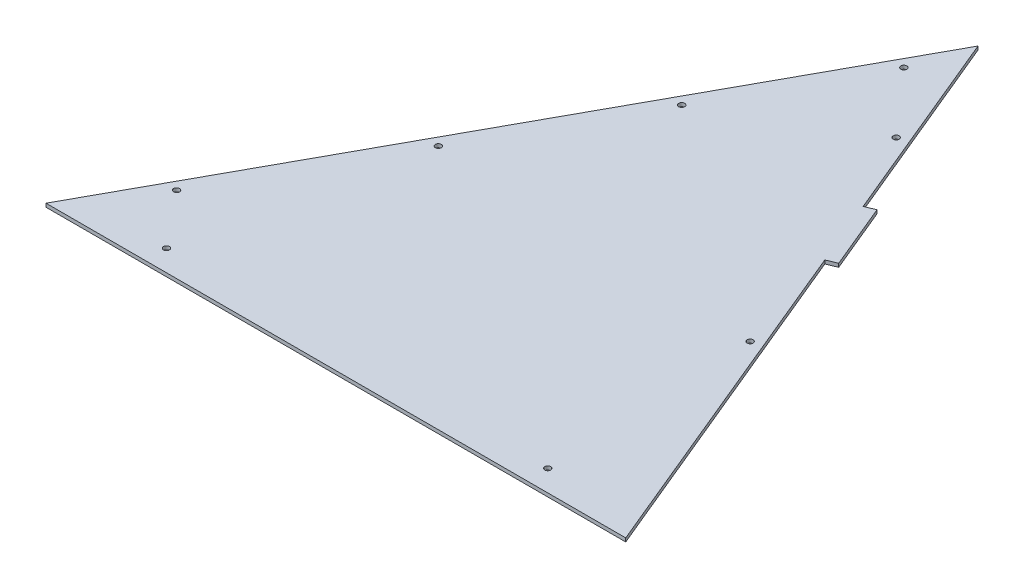
ISO-10303-21;
HEADER;
FILE_DESCRIPTION(('STEP AP214'),'2;1');
FILE_NAME('part.step','',(''),(''),'','','');
FILE_SCHEMA(('AUTOMOTIVE_DESIGN { 1 0 10303 214 1 1 1 1 }'));
ENDSEC;
DATA;
#1=APPLICATION_CONTEXT('core data for automotive mechanical design processes');
#2=APPLICATION_PROTOCOL_DEFINITION('international standard','automotive_design',2000,#1);
#3=PRODUCT_CONTEXT('',#1,'mechanical');
#4=PRODUCT('Part','Part','',(#3));
#5=PRODUCT_RELATED_PRODUCT_CATEGORY('part','',(#4));
#6=PRODUCT_DEFINITION_FORMATION('','',#4);
#7=PRODUCT_DEFINITION_CONTEXT('part definition',#1,'design');
#8=PRODUCT_DEFINITION('design','',#6,#7);
#9=PRODUCT_DEFINITION_SHAPE('','',#8);
#10=(LENGTH_UNIT() NAMED_UNIT(*) SI_UNIT(.MILLI.,.METRE.));
#11=(NAMED_UNIT(*) PLANE_ANGLE_UNIT() SI_UNIT($,.RADIAN.));
#12=(NAMED_UNIT(*) SI_UNIT($,.STERADIAN.) SOLID_ANGLE_UNIT());
#13=UNCERTAINTY_MEASURE_WITH_UNIT(LENGTH_MEASURE(1.E-05),#10,'distance_accuracy_value','');
#14=(GEOMETRIC_REPRESENTATION_CONTEXT(3) GLOBAL_UNCERTAINTY_ASSIGNED_CONTEXT((#13)) GLOBAL_UNIT_ASSIGNED_CONTEXT((#10,
#11,#12)) REPRESENTATION_CONTEXT('',''));
#15=CARTESIAN_POINT('',(0.,0.,0.));
#16=DIRECTION('',(0.,0.,1.));
#17=DIRECTION('',(1.,0.,0.));
#18=AXIS2_PLACEMENT_3D('',#15,#16,#17);
#19=CARTESIAN_POINT('',(582.411910128227,6.35,-241.667046985241));
#20=DIRECTION('',(-0.923641542951039,0.,0.383257485425952));
#21=DIRECTION('',(0.383257485425952,0.,0.923641542951039));
#22=AXIS2_PLACEMENT_3D('',#19,#20,#21);
#23=PLANE('',#22);
#24=DIRECTION('',(-0.383257485425952,0.,-0.923641542951039));
#25=VECTOR('',#24,1.);
#26=CARTESIAN_POINT('',(582.411910128227,0.,-241.667046985241));
#27=LINE('',#26,#25);
#28=CARTESIAN_POINT('',(682.689669876835,0.,0.));
#29=VERTEX_POINT('',#28);
#30=CARTESIAN_POINT('',(429.674039162705,0.,-609.761730508147));
#31=VERTEX_POINT('',#30);
#32=EDGE_CURVE('E147',#29,#31,#27,.T.);
#33=ORIENTED_EDGE('',*,*,#32,.T.);
#34=DIRECTION('',(0.,1.,0.));
#35=VECTOR('',#34,1.);
#36=CARTESIAN_POINT('',(429.674039162706,6.35,-609.761730508147));
#37=LINE('',#36,#35);
#38=CARTESIAN_POINT('',(429.674039162705,6.35,-609.761730508147));
#39=VERTEX_POINT('',#38);
#40=EDGE_CURVE('E12',#31,#39,#37,.T.);
#41=ORIENTED_EDGE('',*,*,#40,.T.);
#42=DIRECTION('',(-0.383257485425952,0.,-0.923641542951039));
#43=VECTOR('',#42,1.);
#44=CARTESIAN_POINT('',(582.411910128227,6.35,-241.667046985241));
#45=LINE('',#44,#43);
#46=CARTESIAN_POINT('',(682.689669876835,6.35,0.));
#47=VERTEX_POINT('',#46);
#48=EDGE_CURVE('E178',#47,#39,#45,.T.);
#49=ORIENTED_EDGE('',*,*,#48,.F.);
#50=DIRECTION('',(0.,-1.,0.));
#51=VECTOR('',#50,1.);
#52=CARTESIAN_POINT('',(682.689669876835,6.35,0.));
#53=LINE('',#52,#51);
#54=EDGE_CURVE('E136',#47,#29,#53,.T.);
#55=ORIENTED_EDGE('',*,*,#54,.T.);
#56=EDGE_LOOP('',(#33,#41,#49,#55));
#57=FACE_BOUND('',#56,.T.);
#58=ADVANCED_FACE('F62',(#57),#23,.F.);
#59=CARTESIAN_POINT('',(381.000338513609,6.35,-727.06420646293));
#60=VERTEX_POINT('',#59);
#61=CARTESIAN_POINT('',(234.979236566322,6.35,-1078.97163432728));
#62=VERTEX_POINT('',#61);
#63=EDGE_CURVE('E181',#60,#62,#45,.T.);
#64=ORIENTED_EDGE('',*,*,#63,.F.);
#65=DIRECTION('',(0.,-1.,0.));
#66=VECTOR('',#65,1.);
#67=CARTESIAN_POINT('',(381.00033851361,6.35,-727.06420646293));
#68=LINE('',#67,#66);
#69=CARTESIAN_POINT('',(381.000338513609,0.,-727.06420646293));
#70=VERTEX_POINT('',#69);
#71=EDGE_CURVE('E72',#60,#70,#68,.T.);
#72=ORIENTED_EDGE('',*,*,#71,.T.);
#73=CARTESIAN_POINT('',(234.979236566322,0.,-1078.97163432728));
#74=VERTEX_POINT('',#73);
#75=EDGE_CURVE('E149',#70,#74,#27,.T.);
#76=ORIENTED_EDGE('',*,*,#75,.T.);
#77=DIRECTION('',(0.,-1.,0.));
#78=VECTOR('',#77,1.);
#79=CARTESIAN_POINT('',(234.979236566322,6.35,-1078.97163432728));
#80=LINE('',#79,#78);
#81=EDGE_CURVE('E130',#62,#74,#80,.T.);
#82=ORIENTED_EDGE('',*,*,#81,.F.);
#83=EDGE_LOOP('',(#64,#72,#76,#82));
#84=FACE_BOUND('',#83,.T.);
#85=ADVANCED_FACE('F247',(#84),#23,.F.);
#86=CARTESIAN_POINT('',(-273.940274661826,6.35,-150.087054666738));
#87=DIRECTION('',(0.876998951253406,0.,0.480492288700272));
#88=DIRECTION('',(0.480492288700272,0.,-0.876998951253407));
#89=AXIS2_PLACEMENT_3D('',#86,#87,#88);
#90=PLANE('',#89);
#91=DIRECTION('',(-0.480492288700272,0.,0.876998951253406));
#92=VECTOR('',#91,1.);
#93=CARTESIAN_POINT('',(-273.940274661826,0.,-150.087054666738));
#94=LINE('',#93,#92);
#95=CARTESIAN_POINT('',(-356.170330123165,0.,0.));
#96=VERTEX_POINT('',#95);
#97=EDGE_CURVE('E144',#74,#96,#94,.T.);
#98=ORIENTED_EDGE('',*,*,#97,.T.);
#99=DIRECTION('',(0.,-1.,0.));
#100=VECTOR('',#99,1.);
#101=CARTESIAN_POINT('',(-356.170330123165,6.35,0.));
#102=LINE('',#101,#100);
#103=CARTESIAN_POINT('',(-356.170330123165,6.35,0.));
#104=VERTEX_POINT('',#103);
#105=EDGE_CURVE('E133',#104,#96,#102,.T.);
#106=ORIENTED_EDGE('',*,*,#105,.F.);
#107=DIRECTION('',(-0.480492288700272,0.,0.876998951253406));
#108=VECTOR('',#107,1.);
#109=CARTESIAN_POINT('',(-273.940274661826,6.35,-150.087054666738));
#110=LINE('',#109,#108);
#111=EDGE_CURVE('E175',#62,#104,#110,.T.);
#112=ORIENTED_EDGE('',*,*,#111,.F.);
#113=ORIENTED_EDGE('',*,*,#81,.T.);
#114=EDGE_LOOP('',(#98,#106,#112,#113));
#115=FACE_BOUND('',#114,.T.);
#116=ADVANCED_FACE('F256',(#115),#90,.F.);
#117=CARTESIAN_POINT('',(303.667495105244,6.35,-863.72905659177));
#118=DIRECTION('',(0.,-1.,0.));
#119=DIRECTION('',(0.,0.,-1.));
#120=AXIS2_PLACEMENT_3D('',#117,#118,#119);
#121=CYLINDRICAL_SURFACE('',#120,5.35781250000001);
#122=CARTESIAN_POINT('',(303.667495105244,6.35,-863.72905659177));
#123=DIRECTION('',(0.,1.,0.));
#124=DIRECTION('',(0.,0.,1.));
#125=AXIS2_PLACEMENT_3D('',#122,#123,#124);
#126=CIRCLE('',#125,5.35781250000001);
#127=CARTESIAN_POINT('',(303.667495105244,6.35,-858.37124409177));
#128=VERTEX_POINT('',#127);
#129=EDGE_CURVE('E182',#128,#128,#126,.T.);
#130=ORIENTED_EDGE('',*,*,#129,.T.);
#131=EDGE_LOOP('',(#130));
#132=FACE_BOUND('',#131,.T.);
#133=CARTESIAN_POINT('',(303.667495105244,0.,-863.72905659177));
#134=DIRECTION('',(0.,1.,0.));
#135=DIRECTION('',(0.,0.,1.));
#136=AXIS2_PLACEMENT_3D('',#133,#134,#135);
#137=CIRCLE('',#136,5.35781250000001);
#138=CARTESIAN_POINT('',(303.667495105244,0.,-858.37124409177));
#139=VERTEX_POINT('',#138);
#140=EDGE_CURVE('E150',#139,#139,#137,.T.);
#141=ORIENTED_EDGE('',*,*,#140,.F.);
#142=EDGE_LOOP('',(#141));
#143=FACE_BOUND('',#142,.T.);
#144=ADVANCED_FACE('F300',(#132,#143),#121,.F.);
#145=CARTESIAN_POINT('',(489.293265449736,6.35,-416.375307605209));
#146=DIRECTION('',(0.,-1.,0.));
#147=DIRECTION('',(0.,0.,-1.));
#148=AXIS2_PLACEMENT_3D('',#145,#146,#147);
#149=CYLINDRICAL_SURFACE('',#148,5.35781249999985);
#150=CARTESIAN_POINT('',(489.293265449736,6.35,-416.375307605209));
#151=DIRECTION('',(0.,1.,0.));
#152=DIRECTION('',(0.,0.,1.));
#153=AXIS2_PLACEMENT_3D('',#150,#151,#152);
#154=CIRCLE('',#153,5.35781249999985);
#155=CARTESIAN_POINT('',(489.293265449736,6.35,-411.017495105209));
#156=VERTEX_POINT('',#155);
#157=EDGE_CURVE('E185',#156,#156,#154,.T.);
#158=ORIENTED_EDGE('',*,*,#157,.T.);
#159=EDGE_LOOP('',(#158));
#160=FACE_BOUND('',#159,.T.);
#161=CARTESIAN_POINT('',(489.293265449736,0.,-416.375307605209));
#162=DIRECTION('',(0.,1.,0.));
#163=DIRECTION('',(0.,0.,1.));
#164=AXIS2_PLACEMENT_3D('',#161,#162,#163);
#165=CIRCLE('',#164,5.35781249999985);
#166=CARTESIAN_POINT('',(489.293265449736,0.,-411.017495105209));
#167=VERTEX_POINT('',#166);
#168=EDGE_CURVE('E153',#167,#167,#165,.T.);
#169=ORIENTED_EDGE('',*,*,#168,.F.);
#170=EDGE_LOOP('',(#169));
#171=FACE_BOUND('',#170,.T.);
#172=ADVANCED_FACE('F296',(#160,#171),#149,.F.);
#173=CARTESIAN_POINT('',(61.0945420540168,6.35,-721.948850069191));
#174=DIRECTION('',(0.,-1.,0.));
#175=DIRECTION('',(0.,0.,-1.));
#176=AXIS2_PLACEMENT_3D('',#173,#174,#175);
#177=CYLINDRICAL_SURFACE('',#176,5.35781249999985);
#178=CARTESIAN_POINT('',(61.0945420540168,6.35,-721.948850069191));
#179=DIRECTION('',(0.,1.,0.));
#180=DIRECTION('',(0.,0.,1.));
#181=AXIS2_PLACEMENT_3D('',#178,#179,#180);
#182=CIRCLE('',#181,5.35781249999985);
#183=CARTESIAN_POINT('',(61.0945420540168,6.35,-716.591037569191));
#184=VERTEX_POINT('',#183);
#185=EDGE_CURVE('E188',#184,#184,#182,.T.);
#186=ORIENTED_EDGE('',*,*,#185,.T.);
#187=EDGE_LOOP('',(#186));
#188=FACE_BOUND('',#187,.T.);
#189=CARTESIAN_POINT('',(61.0945420540168,0.,-721.948850069191));
#190=DIRECTION('',(0.,1.,0.));
#191=DIRECTION('',(0.,0.,1.));
#192=AXIS2_PLACEMENT_3D('',#189,#190,#191);
#193=CIRCLE('',#192,5.35781249999985);
#194=CARTESIAN_POINT('',(61.0945420540168,0.,-716.591037569191));
#195=VERTEX_POINT('',#194);
#196=EDGE_CURVE('E156',#195,#195,#193,.T.);
#197=ORIENTED_EDGE('',*,*,#196,.F.);
#198=EDGE_LOOP('',(#197));
#199=FACE_BOUND('',#198,.T.);
#200=ADVANCED_FACE('F292',(#188,#199),#177,.F.);
#201=CARTESIAN_POINT('',(-93.2897845660762,6.35,-440.165155055006));
#202=DIRECTION('',(0.,-1.,0.));
#203=DIRECTION('',(0.,0.,-1.));
#204=AXIS2_PLACEMENT_3D('',#201,#202,#203);
#205=CYLINDRICAL_SURFACE('',#204,5.3578125);
#206=CARTESIAN_POINT('',(-93.2897845660762,6.35,-440.165155055006));
#207=DIRECTION('',(0.,1.,0.));
#208=DIRECTION('',(0.,0.,1.));
#209=AXIS2_PLACEMENT_3D('',#206,#207,#208);
#210=CIRCLE('',#209,5.3578125);
#211=CARTESIAN_POINT('',(-93.2897845660762,6.35,-434.807342555006));
#212=VERTEX_POINT('',#211);
#213=EDGE_CURVE('E191',#212,#212,#210,.T.);
#214=ORIENTED_EDGE('',*,*,#213,.T.);
#215=EDGE_LOOP('',(#214));
#216=FACE_BOUND('',#215,.T.);
#217=CARTESIAN_POINT('',(-93.2897845660762,0.,-440.165155055006));
#218=DIRECTION('',(0.,1.,0.));
#219=DIRECTION('',(0.,0.,1.));
#220=AXIS2_PLACEMENT_3D('',#217,#218,#219);
#221=CIRCLE('',#220,5.3578125);
#222=CARTESIAN_POINT('',(-93.2897845660762,0.,-434.807342555006));
#223=VERTEX_POINT('',#222);
#224=EDGE_CURVE('E159',#223,#223,#221,.T.);
#225=ORIENTED_EDGE('',*,*,#224,.F.);
#226=EDGE_LOOP('',(#225));
#227=FACE_BOUND('',#226,.T.);
#228=ADVANCED_FACE('F288',(#216,#227),#205,.F.);
#229=CARTESIAN_POINT('',(-259.300975608302,6.35,-137.16));
#230=DIRECTION('',(0.,-1.,0.));
#231=DIRECTION('',(0.,0.,-1.));
#232=AXIS2_PLACEMENT_3D('',#229,#230,#231);
#233=CYLINDRICAL_SURFACE('',#232,5.35781250000002);
#234=CARTESIAN_POINT('',(-259.300975608302,6.35,-137.16));
#235=DIRECTION('',(0.,1.,0.));
#236=DIRECTION('',(0.,0.,1.));
#237=AXIS2_PLACEMENT_3D('',#234,#235,#236);
#238=CIRCLE('',#237,5.35781250000002);
#239=CARTESIAN_POINT('',(-259.300975608302,6.35,-131.8021875));
#240=VERTEX_POINT('',#239);
#241=EDGE_CURVE('E194',#240,#240,#238,.T.);
#242=ORIENTED_EDGE('',*,*,#241,.T.);
#243=EDGE_LOOP('',(#242));
#244=FACE_BOUND('',#243,.T.);
#245=CARTESIAN_POINT('',(-259.300975608302,0.,-137.16));
#246=DIRECTION('',(0.,1.,0.));
#247=DIRECTION('',(0.,0.,1.));
#248=AXIS2_PLACEMENT_3D('',#245,#246,#247);
#249=CIRCLE('',#248,5.35781250000002);
#250=CARTESIAN_POINT('',(-259.300975608302,0.,-131.8021875));
#251=VERTEX_POINT('',#250);
#252=EDGE_CURVE('E162',#251,#251,#249,.T.);
#253=ORIENTED_EDGE('',*,*,#252,.F.);
#254=EDGE_LOOP('',(#253));
#255=FACE_BOUND('',#254,.T.);
#256=ADVANCED_FACE('F284',(#244,#255),#233,.F.);
#257=CARTESIAN_POINT('',(504.889669876835,6.35,-38.0999999999996));
#258=DIRECTION('',(0.,-1.,0.));
#259=DIRECTION('',(0.,0.,-1.));
#260=AXIS2_PLACEMENT_3D('',#257,#258,#259);
#261=CYLINDRICAL_SURFACE('',#260,5.35781249999997);
#262=CARTESIAN_POINT('',(504.889669876835,6.35,-38.0999999999996));
#263=DIRECTION('',(0.,1.,0.));
#264=DIRECTION('',(0.,0.,1.));
#265=AXIS2_PLACEMENT_3D('',#262,#263,#264);
#266=CIRCLE('',#265,5.35781249999997);
#267=CARTESIAN_POINT('',(504.889669876835,6.35,-32.7421874999996));
#268=VERTEX_POINT('',#267);
#269=EDGE_CURVE('E197',#268,#268,#266,.T.);
#270=ORIENTED_EDGE('',*,*,#269,.T.);
#271=EDGE_LOOP('',(#270));
#272=FACE_BOUND('',#271,.T.);
#273=CARTESIAN_POINT('',(504.889669876835,0.,-38.0999999999996));
#274=DIRECTION('',(0.,1.,0.));
#275=DIRECTION('',(0.,0.,1.));
#276=AXIS2_PLACEMENT_3D('',#273,#274,#275);
#277=CIRCLE('',#276,5.35781249999997);
#278=CARTESIAN_POINT('',(504.889669876835,0.,-32.7421874999996));
#279=VERTEX_POINT('',#278);
#280=EDGE_CURVE('E165',#279,#279,#277,.T.);
#281=ORIENTED_EDGE('',*,*,#280,.F.);
#282=EDGE_LOOP('',(#281));
#283=FACE_BOUND('',#282,.T.);
#284=ADVANCED_FACE('F280',(#272,#283),#261,.F.);
#285=CARTESIAN_POINT('',(-178.370330123165,6.35,-38.1));
#286=DIRECTION('',(0.,-1.,0.));
#287=DIRECTION('',(0.,0.,-1.));
#288=AXIS2_PLACEMENT_3D('',#285,#286,#287);
#289=CYLINDRICAL_SURFACE('',#288,5.3578125);
#290=CARTESIAN_POINT('',(-178.370330123165,6.35,-38.1));
#291=DIRECTION('',(0.,1.,0.));
#292=DIRECTION('',(0.,0.,1.));
#293=AXIS2_PLACEMENT_3D('',#290,#291,#292);
#294=CIRCLE('',#293,5.3578125);
#295=CARTESIAN_POINT('',(-178.370330123165,6.35,-32.7421875));
#296=VERTEX_POINT('',#295);
#297=EDGE_CURVE('E200',#296,#296,#294,.T.);
#298=ORIENTED_EDGE('',*,*,#297,.T.);
#299=EDGE_LOOP('',(#298));
#300=FACE_BOUND('',#299,.T.);
#301=CARTESIAN_POINT('',(-178.370330123165,0.,-38.1));
#302=DIRECTION('',(0.,1.,0.));
#303=DIRECTION('',(0.,0.,1.));
#304=AXIS2_PLACEMENT_3D('',#301,#302,#303);
#305=CIRCLE('',#304,5.3578125);
#306=CARTESIAN_POINT('',(-178.370330123165,0.,-32.7421875));
#307=VERTEX_POINT('',#306);
#308=EDGE_CURVE('E168',#307,#307,#305,.T.);
#309=ORIENTED_EDGE('',*,*,#308,.F.);
#310=EDGE_LOOP('',(#309));
#311=FACE_BOUND('',#310,.T.);
#312=ADVANCED_FACE('F263',(#300,#311),#289,.F.);
#313=CARTESIAN_POINT('',(201.973920890297,6.35,-979.083189991385));
#314=DIRECTION('',(0.,-1.,0.));
#315=DIRECTION('',(0.,0.,-1.));
#316=AXIS2_PLACEMENT_3D('',#313,#314,#315);
#317=CYLINDRICAL_SURFACE('',#316,5.35781249999982);
#318=CARTESIAN_POINT('',(201.973920890297,6.35,-979.083189991385));
#319=DIRECTION('',(0.,1.,0.));
#320=DIRECTION('',(0.,0.,1.));
#321=AXIS2_PLACEMENT_3D('',#318,#319,#320);
#322=CIRCLE('',#321,5.35781249999982);
#323=CARTESIAN_POINT('',(201.973920890297,6.35,-973.725377491385));
#324=VERTEX_POINT('',#323);
#325=EDGE_CURVE('E143',#324,#324,#322,.T.);
#326=ORIENTED_EDGE('',*,*,#325,.T.);
#327=EDGE_LOOP('',(#326));
#328=FACE_BOUND('',#327,.T.);
#329=CARTESIAN_POINT('',(201.973920890297,0.,-979.083189991385));
#330=DIRECTION('',(0.,1.,0.));
#331=DIRECTION('',(0.,0.,1.));
#332=AXIS2_PLACEMENT_3D('',#329,#330,#331);
#333=CIRCLE('',#332,5.35781249999982);
#334=CARTESIAN_POINT('',(201.973920890297,0.,-973.725377491385));
#335=VERTEX_POINT('',#334);
#336=EDGE_CURVE('E109',#335,#335,#333,.T.);
#337=ORIENTED_EDGE('',*,*,#336,.F.);
#338=EDGE_LOOP('',(#337));
#339=FACE_BOUND('',#338,.T.);
#340=ADVANCED_FACE('F206',(#328,#339),#317,.F.);
#341=CARTESIAN_POINT('',(0.,6.35,0.));
#342=DIRECTION('',(0.,0.,-1.));
#343=DIRECTION('',(-1.,0.,0.));
#344=AXIS2_PLACEMENT_3D('',#341,#342,#343);
#345=PLANE('',#344);
#346=DIRECTION('',(1.,0.,0.));
#347=VECTOR('',#346,1.);
#348=CARTESIAN_POINT('',(0.,0.,0.));
#349=LINE('',#348,#347);
#350=EDGE_CURVE('E140',#96,#29,#349,.T.);
#351=ORIENTED_EDGE('',*,*,#350,.T.);
#352=ORIENTED_EDGE('',*,*,#54,.F.);
#353=DIRECTION('',(1.,0.,0.));
#354=VECTOR('',#353,1.);
#355=CARTESIAN_POINT('',(0.,6.35,0.));
#356=LINE('',#355,#354);
#357=EDGE_CURVE('E139',#104,#47,#356,.T.);
#358=ORIENTED_EDGE('',*,*,#357,.F.);
#359=ORIENTED_EDGE('',*,*,#105,.T.);
#360=EDGE_LOOP('',(#351,#352,#358,#359));
#361=FACE_BOUND('',#360,.T.);
#362=ADVANCED_FACE('F212',(#361),#345,.F.);
#363=CARTESIAN_POINT('',(0.,6.35,0.));
#364=DIRECTION('',(0.,1.,0.));
#365=DIRECTION('',(0.,0.,1.));
#366=AXIS2_PLACEMENT_3D('',#363,#364,#365);
#367=PLANE('',#366);
#368=ORIENTED_EDGE('',*,*,#325,.F.);
#369=EDGE_LOOP('',(#368));
#370=FACE_BOUND('',#369,.T.);
#371=ORIENTED_EDGE('',*,*,#297,.F.);
#372=EDGE_LOOP('',(#371));
#373=FACE_BOUND('',#372,.T.);
#374=ORIENTED_EDGE('',*,*,#269,.F.);
#375=EDGE_LOOP('',(#374));
#376=FACE_BOUND('',#375,.T.);
#377=ORIENTED_EDGE('',*,*,#241,.F.);
#378=EDGE_LOOP('',(#377));
#379=FACE_BOUND('',#378,.T.);
#380=ORIENTED_EDGE('',*,*,#213,.F.);
#381=EDGE_LOOP('',(#380));
#382=FACE_BOUND('',#381,.T.);
#383=ORIENTED_EDGE('',*,*,#185,.F.);
#384=EDGE_LOOP('',(#383));
#385=FACE_BOUND('',#384,.T.);
#386=ORIENTED_EDGE('',*,*,#157,.F.);
#387=EDGE_LOOP('',(#386));
#388=FACE_BOUND('',#387,.T.);
#389=ORIENTED_EDGE('',*,*,#129,.F.);
#390=EDGE_LOOP('',(#389));
#391=FACE_BOUND('',#390,.T.);
#392=ORIENTED_EDGE('',*,*,#48,.T.);
#393=DIRECTION('',(-0.923641542951034,0.,0.383257485425964));
#394=VECTOR('',#393,1.);
#395=CARTESIAN_POINT('',(447.269410555927,6.35,-617.062785605514));
#396=LINE('',#395,#394);
#397=CARTESIAN_POINT('',(447.269410555927,6.35,-617.062785605514));
#398=VERTEX_POINT('',#397);
#399=EDGE_CURVE('E121',#398,#39,#396,.T.);
#400=ORIENTED_EDGE('',*,*,#399,.F.);
#401=DIRECTION('',(0.383257485425968,0.,0.923641542951032));
#402=VECTOR('',#401,1.);
#403=CARTESIAN_POINT('',(398.595709906829,6.35,-734.365261560295));
#404=LINE('',#403,#402);
#405=CARTESIAN_POINT('',(398.595709906829,6.35,-734.365261560295));
#406=VERTEX_POINT('',#405);
#407=EDGE_CURVE('E105',#406,#398,#404,.T.);
#408=ORIENTED_EDGE('',*,*,#407,.F.);
#409=DIRECTION('',(0.923641542951038,0.,-0.383257485425954));
#410=VECTOR('',#409,1.);
#411=CARTESIAN_POINT('',(381.000338513609,6.35,-727.06420646293));
#412=LINE('',#411,#410);
#413=EDGE_CURVE('E123',#60,#406,#412,.T.);
#414=ORIENTED_EDGE('',*,*,#413,.F.);
#415=ORIENTED_EDGE('',*,*,#63,.T.);
#416=ORIENTED_EDGE('',*,*,#111,.T.);
#417=ORIENTED_EDGE('',*,*,#357,.T.);
#418=EDGE_LOOP('',(#392,#400,#408,#414,#415,#416,#417));
#419=FACE_BOUND('',#418,.T.);
#420=ADVANCED_FACE('F209',(#370,#373,#376,#379,#382,#385,#388,#391,#419),#367,.T.);
#421=CARTESIAN_POINT('',(0.,0.,0.));
#422=DIRECTION('',(0.,1.,0.));
#423=DIRECTION('',(0.,0.,1.));
#424=AXIS2_PLACEMENT_3D('',#421,#422,#423);
#425=PLANE('',#424);
#426=ORIENTED_EDGE('',*,*,#336,.T.);
#427=EDGE_LOOP('',(#426));
#428=FACE_BOUND('',#427,.T.);
#429=ORIENTED_EDGE('',*,*,#308,.T.);
#430=EDGE_LOOP('',(#429));
#431=FACE_BOUND('',#430,.T.);
#432=ORIENTED_EDGE('',*,*,#280,.T.);
#433=EDGE_LOOP('',(#432));
#434=FACE_BOUND('',#433,.T.);
#435=ORIENTED_EDGE('',*,*,#252,.T.);
#436=EDGE_LOOP('',(#435));
#437=FACE_BOUND('',#436,.T.);
#438=ORIENTED_EDGE('',*,*,#224,.T.);
#439=EDGE_LOOP('',(#438));
#440=FACE_BOUND('',#439,.T.);
#441=ORIENTED_EDGE('',*,*,#196,.T.);
#442=EDGE_LOOP('',(#441));
#443=FACE_BOUND('',#442,.T.);
#444=ORIENTED_EDGE('',*,*,#168,.T.);
#445=EDGE_LOOP('',(#444));
#446=FACE_BOUND('',#445,.T.);
#447=ORIENTED_EDGE('',*,*,#140,.T.);
#448=EDGE_LOOP('',(#447));
#449=FACE_BOUND('',#448,.T.);
#450=ORIENTED_EDGE('',*,*,#32,.F.);
#451=ORIENTED_EDGE('',*,*,#350,.F.);
#452=ORIENTED_EDGE('',*,*,#97,.F.);
#453=ORIENTED_EDGE('',*,*,#75,.F.);
#454=DIRECTION('',(0.923641542951038,0.,-0.383257485425954));
#455=VECTOR('',#454,1.);
#456=CARTESIAN_POINT('',(381.000338513609,0.,-727.06420646293));
#457=LINE('',#456,#455);
#458=CARTESIAN_POINT('',(398.595709906829,0.,-734.365261560295));
#459=VERTEX_POINT('',#458);
#460=EDGE_CURVE('E117',#70,#459,#457,.T.);
#461=ORIENTED_EDGE('',*,*,#460,.T.);
#462=DIRECTION('',(0.383257485425968,0.,0.923641542951032));
#463=VECTOR('',#462,1.);
#464=CARTESIAN_POINT('',(398.595709906829,0.,-734.365261560295));
#465=LINE('',#464,#463);
#466=CARTESIAN_POINT('',(447.269410555927,0.,-617.062785605514));
#467=VERTEX_POINT('',#466);
#468=EDGE_CURVE('E103',#459,#467,#465,.T.);
#469=ORIENTED_EDGE('',*,*,#468,.T.);
#470=DIRECTION('',(-0.923641542951034,0.,0.383257485425964));
#471=VECTOR('',#470,1.);
#472=CARTESIAN_POINT('',(447.269410555927,0.,-617.062785605514));
#473=LINE('',#472,#471);
#474=EDGE_CURVE('E112',#467,#31,#473,.T.);
#475=ORIENTED_EDGE('',*,*,#474,.T.);
#476=EDGE_LOOP('',(#450,#451,#452,#453,#461,#469,#475));
#477=FACE_BOUND('',#476,.T.);
#478=ADVANCED_FACE('F119',(#428,#431,#434,#437,#440,#443,#446,#449,#477),#425,.F.);
#479=CARTESIAN_POINT('',(398.595709906829,6.35,-734.365261560295));
#480=DIRECTION('',(0.923641542951032,0.,-0.383257485425968));
#481=DIRECTION('',(-0.383257485425968,0.,-0.923641542951032));
#482=AXIS2_PLACEMENT_3D('',#479,#480,#481);
#483=PLANE('',#482);
#484=ORIENTED_EDGE('',*,*,#468,.F.);
#485=DIRECTION('',(0.,-1.,0.));
#486=VECTOR('',#485,1.);
#487=CARTESIAN_POINT('',(398.595709906829,6.35,-734.365261560295));
#488=LINE('',#487,#486);
#489=EDGE_CURVE('E66',#406,#459,#488,.T.);
#490=ORIENTED_EDGE('',*,*,#489,.F.);
#491=ORIENTED_EDGE('',*,*,#407,.T.);
#492=DIRECTION('',(0.,-1.,0.));
#493=VECTOR('',#492,1.);
#494=CARTESIAN_POINT('',(447.269410555927,6.35,-617.062785605514));
#495=LINE('',#494,#493);
#496=EDGE_CURVE('E99',#398,#467,#495,.T.);
#497=ORIENTED_EDGE('',*,*,#496,.T.);
#498=EDGE_LOOP('',(#484,#490,#491,#497));
#499=FACE_BOUND('',#498,.T.);
#500=ADVANCED_FACE('F101',(#499),#483,.T.);
#501=CARTESIAN_POINT('',(381.000338513609,6.35,-727.06420646293));
#502=DIRECTION('',(-0.383257485425954,0.,-0.923641542951038));
#503=DIRECTION('',(-0.923641542951039,0.,0.383257485425954));
#504=AXIS2_PLACEMENT_3D('',#501,#502,#503);
#505=PLANE('',#504);
#506=ORIENTED_EDGE('',*,*,#460,.F.);
#507=ORIENTED_EDGE('',*,*,#71,.F.);
#508=ORIENTED_EDGE('',*,*,#413,.T.);
#509=ORIENTED_EDGE('',*,*,#489,.T.);
#510=EDGE_LOOP('',(#506,#507,#508,#509));
#511=FACE_BOUND('',#510,.T.);
#512=ADVANCED_FACE('F251',(#511),#505,.T.);
#513=CARTESIAN_POINT('',(447.269410555927,6.35,-617.062785605514));
#514=DIRECTION('',(0.383257485425964,0.,0.923641542951034));
#515=DIRECTION('',(0.923641542951034,0.,-0.383257485425964));
#516=AXIS2_PLACEMENT_3D('',#513,#514,#515);
#517=PLANE('',#516);
#518=ORIENTED_EDGE('',*,*,#474,.F.);
#519=ORIENTED_EDGE('',*,*,#496,.F.);
#520=ORIENTED_EDGE('',*,*,#399,.T.);
#521=ORIENTED_EDGE('',*,*,#40,.F.);
#522=EDGE_LOOP('',(#518,#519,#520,#521));
#523=FACE_BOUND('',#522,.T.);
#524=ADVANCED_FACE('F64',(#523),#517,.T.);
#525=CLOSED_SHELL('',(#58,#85,#116,#144,#172,#200,#228,#256,#284,#312,#340,#362,#420,#478,#500,
#512,#524));
#526=MANIFOLD_SOLID_BREP('B2',#525);
#527=ADVANCED_BREP_SHAPE_REPRESENTATION('',(#18,#526),#14);
#528=SHAPE_DEFINITION_REPRESENTATION(#9,#527);
ENDSEC;
END-ISO-10303-21;
